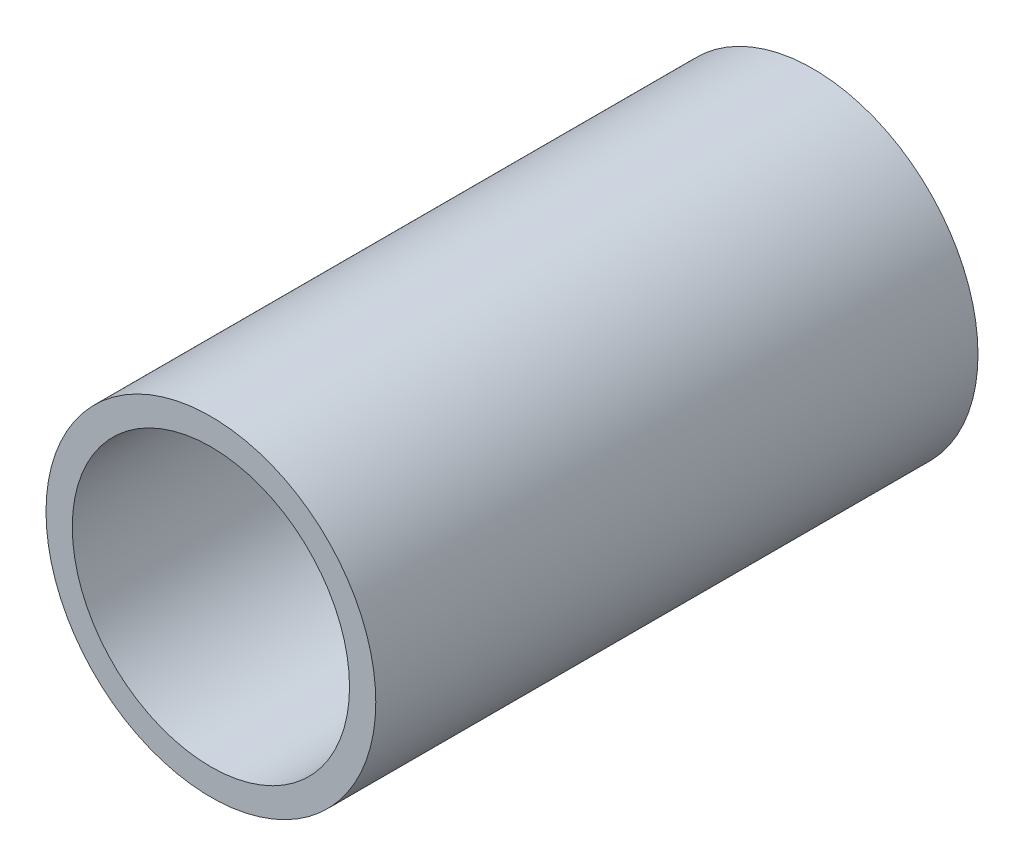
ISO-10303-21;
HEADER;
FILE_DESCRIPTION(('STEP AP214'),'2;1');
FILE_NAME('part.step','',(''),(''),'','','');
FILE_SCHEMA(('AUTOMOTIVE_DESIGN { 1 0 10303 214 1 1 1 1 }'));
ENDSEC;
DATA;
#1=APPLICATION_CONTEXT('core data for automotive mechanical design processes');
#2=APPLICATION_PROTOCOL_DEFINITION('international standard','automotive_design',2000,#1);
#3=PRODUCT_CONTEXT('',#1,'mechanical');
#4=PRODUCT('Part','Part','',(#3));
#5=PRODUCT_RELATED_PRODUCT_CATEGORY('part','',(#4));
#6=PRODUCT_DEFINITION_FORMATION('','',#4);
#7=PRODUCT_DEFINITION_CONTEXT('part definition',#1,'design');
#8=PRODUCT_DEFINITION('design','',#6,#7);
#9=PRODUCT_DEFINITION_SHAPE('','',#8);
#10=(LENGTH_UNIT() NAMED_UNIT(*) SI_UNIT(.MILLI.,.METRE.));
#11=(NAMED_UNIT(*) PLANE_ANGLE_UNIT() SI_UNIT($,.RADIAN.));
#12=(NAMED_UNIT(*) SI_UNIT($,.STERADIAN.) SOLID_ANGLE_UNIT());
#13=UNCERTAINTY_MEASURE_WITH_UNIT(LENGTH_MEASURE(1.E-05),#10,'distance_accuracy_value','');
#14=(GEOMETRIC_REPRESENTATION_CONTEXT(3) GLOBAL_UNCERTAINTY_ASSIGNED_CONTEXT((#13)) GLOBAL_UNIT_ASSIGNED_CONTEXT((#10,
#11,#12)) REPRESENTATION_CONTEXT('',''));
#15=CARTESIAN_POINT('',(0.,0.,0.));
#16=DIRECTION('',(0.,0.,1.));
#17=DIRECTION('',(1.,0.,0.));
#18=AXIS2_PLACEMENT_3D('',#15,#16,#17);
#19=CARTESIAN_POINT('',(0.,0.,17.4625));
#20=DIRECTION('',(0.,0.,-1.));
#21=DIRECTION('',(-1.,0.,0.));
#22=AXIS2_PLACEMENT_3D('',#19,#20,#21);
#23=CYLINDRICAL_SURFACE('',#22,8.0391);
#24=CARTESIAN_POINT('',(0.,0.,-17.4625));
#25=DIRECTION('',(0.,0.,-1.));
#26=DIRECTION('',(-1.,0.,0.));
#27=AXIS2_PLACEMENT_3D('',#24,#25,#26);
#28=CIRCLE('',#27,8.0391);
#29=CARTESIAN_POINT('',(-8.0391,0.,-17.4625));
#30=VERTEX_POINT('',#29);
#31=EDGE_CURVE('E26',#30,#30,#28,.T.);
#32=ORIENTED_EDGE('',*,*,#31,.T.);
#33=EDGE_LOOP('',(#32));
#34=FACE_BOUND('',#33,.T.);
#35=CARTESIAN_POINT('',(0.,0.,17.4625));
#36=DIRECTION('',(0.,0.,-1.));
#37=DIRECTION('',(-1.,0.,0.));
#38=AXIS2_PLACEMENT_3D('',#35,#36,#37);
#39=CIRCLE('',#38,8.0391);
#40=CARTESIAN_POINT('',(-8.0391,0.,17.4625));
#41=VERTEX_POINT('',#40);
#42=EDGE_CURVE('E17',#41,#41,#39,.T.);
#43=ORIENTED_EDGE('',*,*,#42,.F.);
#44=EDGE_LOOP('',(#43));
#45=FACE_BOUND('',#44,.T.);
#46=ADVANCED_FACE('F14',(#34,#45),#23,.F.);
#47=CARTESIAN_POINT('',(0.,0.,17.4625));
#48=DIRECTION('',(0.,0.,1.));
#49=DIRECTION('',(1.,0.,0.));
#50=AXIS2_PLACEMENT_3D('',#47,#48,#49);
#51=PLANE('',#50);
#52=ORIENTED_EDGE('',*,*,#42,.T.);
#53=EDGE_LOOP('',(#52));
#54=FACE_BOUND('',#53,.T.);
#55=CARTESIAN_POINT('',(0.,0.,17.4625));
#56=DIRECTION('',(0.,0.,-1.));
#57=DIRECTION('',(-1.,0.,0.));
#58=AXIS2_PLACEMENT_3D('',#55,#56,#57);
#59=CIRCLE('',#58,9.5631);
#60=CARTESIAN_POINT('',(-9.5631,0.,17.4625));
#61=VERTEX_POINT('',#60);
#62=EDGE_CURVE('E21',#61,#61,#59,.T.);
#63=ORIENTED_EDGE('',*,*,#62,.F.);
#64=EDGE_LOOP('',(#63));
#65=FACE_BOUND('',#64,.T.);
#66=ADVANCED_FACE('F34',(#54,#65),#51,.T.);
#67=CARTESIAN_POINT('',(0.,0.,-17.4625));
#68=DIRECTION('',(0.,0.,1.));
#69=DIRECTION('',(1.,0.,0.));
#70=AXIS2_PLACEMENT_3D('',#67,#68,#69);
#71=PLANE('',#70);
#72=ORIENTED_EDGE('',*,*,#31,.F.);
#73=EDGE_LOOP('',(#72));
#74=FACE_BOUND('',#73,.T.);
#75=CARTESIAN_POINT('',(0.,0.,-17.4625));
#76=DIRECTION('',(0.,0.,-1.));
#77=DIRECTION('',(-1.,0.,0.));
#78=AXIS2_PLACEMENT_3D('',#75,#76,#77);
#79=CIRCLE('',#78,9.5631);
#80=CARTESIAN_POINT('',(-9.5631,0.,-17.4625));
#81=VERTEX_POINT('',#80);
#82=EDGE_CURVE('E10',#81,#81,#79,.F.);
#83=ORIENTED_EDGE('',*,*,#82,.F.);
#84=EDGE_LOOP('',(#83));
#85=FACE_BOUND('',#84,.T.);
#86=ADVANCED_FACE('F42',(#74,#85),#71,.F.);
#87=CARTESIAN_POINT('',(0.,0.,17.4625));
#88=DIRECTION('',(0.,0.,-1.));
#89=DIRECTION('',(-1.,0.,0.));
#90=AXIS2_PLACEMENT_3D('',#87,#88,#89);
#91=CYLINDRICAL_SURFACE('',#90,9.5631);
#92=ORIENTED_EDGE('',*,*,#82,.T.);
#93=EDGE_LOOP('',(#92));
#94=FACE_BOUND('',#93,.T.);
#95=ORIENTED_EDGE('',*,*,#62,.T.);
#96=EDGE_LOOP('',(#95));
#97=FACE_BOUND('',#96,.T.);
#98=ADVANCED_FACE('F43',(#94,#97),#91,.T.);
#99=CLOSED_SHELL('',(#46,#66,#86,#98));
#100=MANIFOLD_SOLID_BREP('B1',#99);
#101=ADVANCED_BREP_SHAPE_REPRESENTATION('',(#18,#100),#14);
#102=SHAPE_DEFINITION_REPRESENTATION(#9,#101);
ENDSEC;
END-ISO-10303-21;
